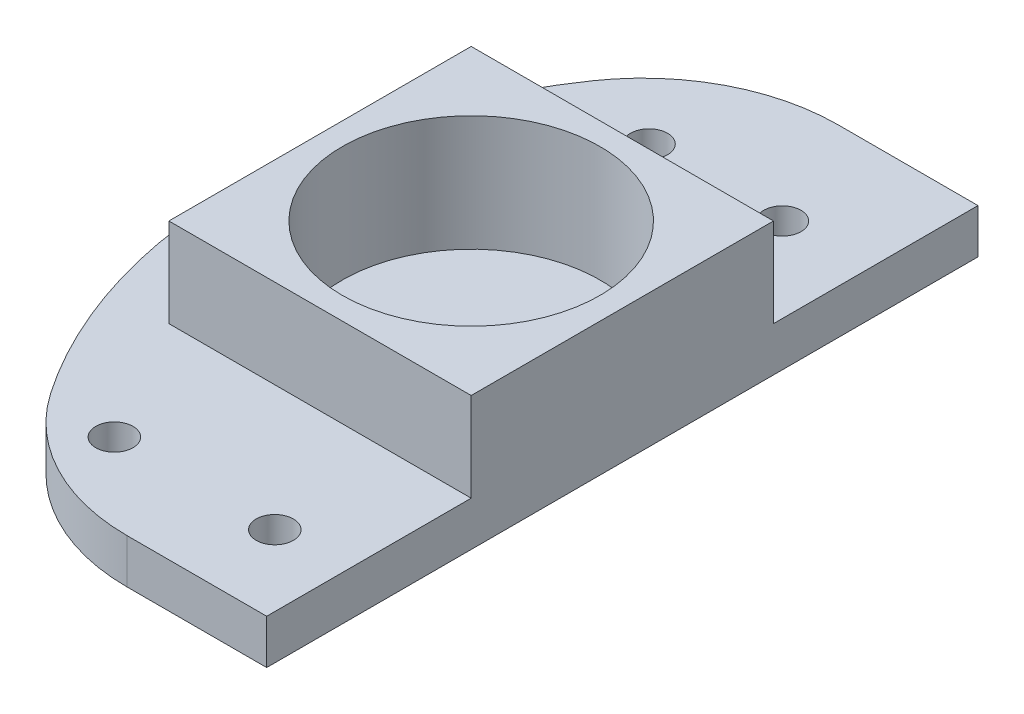
ISO-10303-21;
HEADER;
FILE_DESCRIPTION(('STEP AP214'),'2;1');
FILE_NAME('part.step','',(''),(''),'','','');
FILE_SCHEMA(('AUTOMOTIVE_DESIGN { 1 0 10303 214 1 1 1 1 }'));
ENDSEC;
DATA;
#1=APPLICATION_CONTEXT('core data for automotive mechanical design processes');
#2=APPLICATION_PROTOCOL_DEFINITION('international standard','automotive_design',2000,#1);
#3=PRODUCT_CONTEXT('',#1,'mechanical');
#4=PRODUCT('Part','Part','',(#3));
#5=PRODUCT_RELATED_PRODUCT_CATEGORY('part','',(#4));
#6=PRODUCT_DEFINITION_FORMATION('','',#4);
#7=PRODUCT_DEFINITION_CONTEXT('part definition',#1,'design');
#8=PRODUCT_DEFINITION('design','',#6,#7);
#9=PRODUCT_DEFINITION_SHAPE('','',#8);
#10=(LENGTH_UNIT() NAMED_UNIT(*) SI_UNIT(.MILLI.,.METRE.));
#11=(NAMED_UNIT(*) PLANE_ANGLE_UNIT() SI_UNIT($,.RADIAN.));
#12=(NAMED_UNIT(*) SI_UNIT($,.STERADIAN.) SOLID_ANGLE_UNIT());
#13=UNCERTAINTY_MEASURE_WITH_UNIT(LENGTH_MEASURE(1.E-05),#10,'distance_accuracy_value','');
#14=(GEOMETRIC_REPRESENTATION_CONTEXT(3) GLOBAL_UNCERTAINTY_ASSIGNED_CONTEXT((#13)) GLOBAL_UNIT_ASSIGNED_CONTEXT((#10,
#11,#12)) REPRESENTATION_CONTEXT('',''));
#15=CARTESIAN_POINT('',(0.,0.,0.));
#16=DIRECTION('',(0.,0.,1.));
#17=DIRECTION('',(1.,0.,0.));
#18=AXIS2_PLACEMENT_3D('',#15,#16,#17);
#19=CARTESIAN_POINT('',(0.,6.35,0.));
#20=DIRECTION('',(0.,1.,0.));
#21=DIRECTION('',(0.,0.,1.));
#22=AXIS2_PLACEMENT_3D('',#19,#20,#21);
#23=PLANE('',#22);
#24=CARTESIAN_POINT('',(-9.525,6.35,-34.925));
#25=DIRECTION('',(0.,1.,0.));
#26=DIRECTION('',(0.,0.,1.));
#27=AXIS2_PLACEMENT_3D('',#24,#25,#26);
#28=CIRCLE('',#27,2.65429999999999);
#29=CARTESIAN_POINT('',(-9.525,6.35,-32.2707));
#30=VERTEX_POINT('',#29);
#31=EDGE_CURVE('E366',#30,#30,#28,.T.);
#32=ORIENTED_EDGE('',*,*,#31,.F.);
#33=EDGE_LOOP('',(#32));
#34=FACE_BOUND('',#33,.T.);
#35=CARTESIAN_POINT('',(9.525,6.35,-34.925));
#36=DIRECTION('',(0.,1.,0.));
#37=DIRECTION('',(0.,0.,1.));
#38=AXIS2_PLACEMENT_3D('',#35,#36,#37);
#39=CIRCLE('',#38,2.65429999999999);
#40=CARTESIAN_POINT('',(9.525,6.35,-32.2707));
#41=VERTEX_POINT('',#40);
#42=EDGE_CURVE('E368',#41,#41,#39,.T.);
#43=ORIENTED_EDGE('',*,*,#42,.F.);
#44=EDGE_LOOP('',(#43));
#45=FACE_BOUND('',#44,.T.);
#46=CARTESIAN_POINT('',(11.4568909611128,6.35,39.5116158235074));
#47=DIRECTION('',(0.,1.,0.));
#48=DIRECTION('',(0.,0.,1.));
#49=AXIS2_PLACEMENT_3D('',#46,#47,#48);
#50=CIRCLE('',#49,2.65429999999999);
#51=CARTESIAN_POINT('',(11.4568909611128,6.35,42.1659158235074));
#52=VERTEX_POINT('',#51);
#53=EDGE_CURVE('E376',#52,#52,#50,.T.);
#54=ORIENTED_EDGE('',*,*,#53,.F.);
#55=EDGE_LOOP('',(#54));
#56=FACE_BOUND('',#55,.T.);
#57=CARTESIAN_POINT('',(-11.4568909611128,6.35,39.5116158235074));
#58=DIRECTION('',(0.,1.,0.));
#59=DIRECTION('',(0.,0.,1.));
#60=AXIS2_PLACEMENT_3D('',#57,#58,#59);
#61=CIRCLE('',#60,2.65429999999999);
#62=CARTESIAN_POINT('',(-11.4568909611128,6.35,42.1659158235074));
#63=VERTEX_POINT('',#62);
#64=EDGE_CURVE('E146',#63,#63,#61,.T.);
#65=ORIENTED_EDGE('',*,*,#64,.F.);
#66=EDGE_LOOP('',(#65));
#67=FACE_BOUND('',#66,.T.);
#68=DIRECTION('',(-1.,0.,0.));
#69=VECTOR('',#68,1.);
#70=CARTESIAN_POINT('',(0.,6.35,-50.8));
#71=LINE('',#70,#69);
#72=CARTESIAN_POINT('',(21.59,6.35,-50.8));
#73=VERTEX_POINT('',#72);
#74=CARTESIAN_POINT('',(1.63161633297087,6.35,-50.8));
#75=VERTEX_POINT('',#74);
#76=EDGE_CURVE('E130',#73,#75,#71,.T.);
#77=ORIENTED_EDGE('',*,*,#76,.T.);
#78=CARTESIAN_POINT('',(1.63161633297088,6.35,-22.86));
#79=DIRECTION('',(0.,1.,0.));
#80=DIRECTION('',(0.,0.,1.));
#81=AXIS2_PLACEMENT_3D('',#78,#79,#80);
#82=CIRCLE('',#81,27.94);
#83=CARTESIAN_POINT('',(-21.4015421788103,6.35,-38.6750943396226));
#84=VERTEX_POINT('',#83);
#85=EDGE_CURVE('E197',#75,#84,#82,.T.);
#86=ORIENTED_EDGE('',*,*,#85,.T.);
#87=CARTESIAN_POINT('',(34.925,6.35,0.));
#88=DIRECTION('',(0.,1.,0.));
#89=DIRECTION('',(0.,0.,1.));
#90=AXIS2_PLACEMENT_3D('',#87,#88,#89);
#91=CIRCLE('',#90,68.326);
#92=CARTESIAN_POINT('',(-21.4015421788102,6.35,38.6750943396227));
#93=VERTEX_POINT('',#92);
#94=EDGE_CURVE('E135',#84,#93,#91,.T.);
#95=ORIENTED_EDGE('',*,*,#94,.T.);
#96=CARTESIAN_POINT('',(1.63161633297088,6.35,22.86));
#97=DIRECTION('',(0.,1.,0.));
#98=DIRECTION('',(0.,0.,1.));
#99=AXIS2_PLACEMENT_3D('',#96,#97,#98);
#100=CIRCLE('',#99,27.94);
#101=CARTESIAN_POINT('',(1.63161633297089,6.35,50.8));
#102=VERTEX_POINT('',#101);
#103=EDGE_CURVE('E195',#93,#102,#100,.T.);
#104=ORIENTED_EDGE('',*,*,#103,.T.);
#105=DIRECTION('',(-1.,0.,0.));
#106=VECTOR('',#105,1.);
#107=CARTESIAN_POINT('',(0.,6.35,50.8));
#108=LINE('',#107,#106);
#109=CARTESIAN_POINT('',(21.59,6.35,50.8));
#110=VERTEX_POINT('',#109);
#111=EDGE_CURVE('E144',#110,#102,#108,.T.);
#112=ORIENTED_EDGE('',*,*,#111,.F.);
#113=DIRECTION('',(0.,0.,-1.));
#114=VECTOR('',#113,1.);
#115=CARTESIAN_POINT('',(21.59,6.35,0.));
#116=LINE('',#115,#114);
#117=CARTESIAN_POINT('',(21.59,6.35,21.59));
#118=VERTEX_POINT('',#117);
#119=EDGE_CURVE('E141',#110,#118,#116,.T.);
#120=ORIENTED_EDGE('',*,*,#119,.T.);
#121=DIRECTION('',(1.,0.,0.));
#122=VECTOR('',#121,1.);
#123=CARTESIAN_POINT('',(0.,6.35,21.59));
#124=LINE('',#123,#122);
#125=CARTESIAN_POINT('',(-21.59,6.35,21.59));
#126=VERTEX_POINT('',#125);
#127=EDGE_CURVE('E155',#126,#118,#124,.T.);
#128=ORIENTED_EDGE('',*,*,#127,.F.);
#129=DIRECTION('',(0.,0.,-1.));
#130=VECTOR('',#129,1.);
#131=CARTESIAN_POINT('',(-21.59,6.35,0.));
#132=LINE('',#131,#130);
#133=CARTESIAN_POINT('',(-21.59,6.35,-21.59));
#134=VERTEX_POINT('',#133);
#135=EDGE_CURVE('E158',#126,#134,#132,.T.);
#136=ORIENTED_EDGE('',*,*,#135,.T.);
#137=DIRECTION('',(1.,0.,0.));
#138=VECTOR('',#137,1.);
#139=CARTESIAN_POINT('',(0.,6.35,-21.59));
#140=LINE('',#139,#138);
#141=CARTESIAN_POINT('',(21.59,6.35,-21.59));
#142=VERTEX_POINT('',#141);
#143=EDGE_CURVE('E140',#134,#142,#140,.T.);
#144=ORIENTED_EDGE('',*,*,#143,.T.);
#145=EDGE_CURVE('E117',#142,#73,#116,.T.);
#146=ORIENTED_EDGE('',*,*,#145,.T.);
#147=EDGE_LOOP('',(#77,#86,#95,#104,#112,#120,#128,#136,#144,#146));
#148=FACE_BOUND('',#147,.T.);
#149=ADVANCED_FACE('F37',(#34,#45,#56,#67,#148),#23,.T.);
#150=CARTESIAN_POINT('',(0.,19.05,0.));
#151=DIRECTION('',(0.,1.,0.));
#152=DIRECTION('',(0.,0.,1.));
#153=AXIS2_PLACEMENT_3D('',#150,#151,#152);
#154=PLANE('',#153);
#155=CARTESIAN_POINT('',(0.,19.05,0.));
#156=DIRECTION('',(0.,1.,0.));
#157=DIRECTION('',(0.,0.,1.));
#158=AXIS2_PLACEMENT_3D('',#155,#156,#157);
#159=CIRCLE('',#158,18.415);
#160=CARTESIAN_POINT('',(0.,19.05,18.415));
#161=VERTEX_POINT('',#160);
#162=EDGE_CURVE('E175',#161,#161,#159,.T.);
#163=ORIENTED_EDGE('',*,*,#162,.F.);
#164=EDGE_LOOP('',(#163));
#165=FACE_BOUND('',#164,.T.);
#166=DIRECTION('',(1.,0.,0.));
#167=VECTOR('',#166,1.);
#168=CARTESIAN_POINT('',(0.,19.05,21.59));
#169=LINE('',#168,#167);
#170=CARTESIAN_POINT('',(-21.59,19.05,21.59));
#171=VERTEX_POINT('',#170);
#172=CARTESIAN_POINT('',(21.59,19.05,21.59));
#173=VERTEX_POINT('',#172);
#174=EDGE_CURVE('E165',#171,#173,#169,.T.);
#175=ORIENTED_EDGE('',*,*,#174,.T.);
#176=DIRECTION('',(0.,0.,-1.));
#177=VECTOR('',#176,1.);
#178=CARTESIAN_POINT('',(21.59,19.05,0.));
#179=LINE('',#178,#177);
#180=CARTESIAN_POINT('',(21.59,19.05,-21.59));
#181=VERTEX_POINT('',#180);
#182=EDGE_CURVE('E125',#173,#181,#179,.T.);
#183=ORIENTED_EDGE('',*,*,#182,.T.);
#184=DIRECTION('',(1.,0.,0.));
#185=VECTOR('',#184,1.);
#186=CARTESIAN_POINT('',(0.,19.05,-21.59));
#187=LINE('',#186,#185);
#188=CARTESIAN_POINT('',(-21.59,19.05,-21.59));
#189=VERTEX_POINT('',#188);
#190=EDGE_CURVE('E159',#189,#181,#187,.T.);
#191=ORIENTED_EDGE('',*,*,#190,.F.);
#192=DIRECTION('',(0.,0.,-1.));
#193=VECTOR('',#192,1.);
#194=CARTESIAN_POINT('',(-21.59,19.05,0.));
#195=LINE('',#194,#193);
#196=EDGE_CURVE('E168',#171,#189,#195,.T.);
#197=ORIENTED_EDGE('',*,*,#196,.F.);
#198=EDGE_LOOP('',(#175,#183,#191,#197));
#199=FACE_BOUND('',#198,.T.);
#200=ADVANCED_FACE('F229',(#165,#199),#154,.T.);
#201=CARTESIAN_POINT('',(0.,2.54,0.));
#202=DIRECTION('',(0.,1.,0.));
#203=DIRECTION('',(0.,0.,1.));
#204=AXIS2_PLACEMENT_3D('',#201,#202,#203);
#205=CYLINDRICAL_SURFACE('',#204,18.415);
#206=CARTESIAN_POINT('',(0.,2.54,0.));
#207=DIRECTION('',(0.,1.,0.));
#208=DIRECTION('',(0.,0.,1.));
#209=AXIS2_PLACEMENT_3D('',#206,#207,#208);
#210=CIRCLE('',#209,18.415);
#211=CARTESIAN_POINT('',(0.,2.54,18.415));
#212=VERTEX_POINT('',#211);
#213=EDGE_CURVE('E182',#212,#212,#210,.T.);
#214=ORIENTED_EDGE('',*,*,#213,.F.);
#215=EDGE_LOOP('',(#214));
#216=FACE_BOUND('',#215,.T.);
#217=ORIENTED_EDGE('',*,*,#162,.T.);
#218=EDGE_LOOP('',(#217));
#219=FACE_BOUND('',#218,.T.);
#220=ADVANCED_FACE('F231',(#216,#219),#205,.F.);
#221=CARTESIAN_POINT('',(0.,2.54,0.));
#222=DIRECTION('',(0.,1.,0.));
#223=DIRECTION('',(0.,0.,1.));
#224=AXIS2_PLACEMENT_3D('',#221,#222,#223);
#225=PLANE('',#224);
#226=ORIENTED_EDGE('',*,*,#213,.T.);
#227=EDGE_LOOP('',(#226));
#228=FACE_BOUND('',#227,.T.);
#229=ADVANCED_FACE('F238',(#228),#225,.T.);
#230=CARTESIAN_POINT('',(21.59,6.35,0.));
#231=DIRECTION('',(1.,0.,0.));
#232=DIRECTION('',(0.,0.,-1.));
#233=AXIS2_PLACEMENT_3D('',#230,#231,#232);
#234=PLANE('',#233);
#235=ORIENTED_EDGE('',*,*,#182,.F.);
#236=DIRECTION('',(0.,1.,0.));
#237=VECTOR('',#236,1.);
#238=CARTESIAN_POINT('',(21.59,6.35,21.59));
#239=LINE('',#238,#237);
#240=EDGE_CURVE('E162',#118,#173,#239,.T.);
#241=ORIENTED_EDGE('',*,*,#240,.F.);
#242=ORIENTED_EDGE('',*,*,#119,.F.);
#243=DIRECTION('',(0.,1.,0.));
#244=VECTOR('',#243,1.);
#245=CARTESIAN_POINT('',(21.59,-6.35,50.8));
#246=LINE('',#245,#244);
#247=CARTESIAN_POINT('',(21.59,0.,50.8));
#248=VERTEX_POINT('',#247);
#249=EDGE_CURVE('E126',#248,#110,#246,.T.);
#250=ORIENTED_EDGE('',*,*,#249,.F.);
#251=DIRECTION('',(0.,0.,-1.));
#252=VECTOR('',#251,1.);
#253=CARTESIAN_POINT('',(21.59,0.,0.));
#254=LINE('',#253,#252);
#255=CARTESIAN_POINT('',(21.59,0.,-50.8));
#256=VERTEX_POINT('',#255);
#257=EDGE_CURVE('E121',#248,#256,#254,.T.);
#258=ORIENTED_EDGE('',*,*,#257,.T.);
#259=DIRECTION('',(0.,1.,0.));
#260=VECTOR('',#259,1.);
#261=CARTESIAN_POINT('',(21.59,-6.35,-50.8));
#262=LINE('',#261,#260);
#263=EDGE_CURVE('E113',#256,#73,#262,.T.);
#264=ORIENTED_EDGE('',*,*,#263,.T.);
#265=ORIENTED_EDGE('',*,*,#145,.F.);
#266=DIRECTION('',(0.,1.,0.));
#267=VECTOR('',#266,1.);
#268=CARTESIAN_POINT('',(21.59,6.35,-21.59));
#269=LINE('',#268,#267);
#270=EDGE_CURVE('E173',#142,#181,#269,.T.);
#271=ORIENTED_EDGE('',*,*,#270,.T.);
#272=EDGE_LOOP('',(#235,#241,#242,#250,#258,#264,#265,#271));
#273=FACE_BOUND('',#272,.T.);
#274=ADVANCED_FACE('F115',(#273),#234,.T.);
#275=CARTESIAN_POINT('',(0.,6.35,-21.59));
#276=DIRECTION('',(0.,0.,1.));
#277=DIRECTION('',(1.,0.,0.));
#278=AXIS2_PLACEMENT_3D('',#275,#276,#277);
#279=PLANE('',#278);
#280=ORIENTED_EDGE('',*,*,#190,.T.);
#281=ORIENTED_EDGE('',*,*,#270,.F.);
#282=ORIENTED_EDGE('',*,*,#143,.F.);
#283=DIRECTION('',(0.,1.,0.));
#284=VECTOR('',#283,1.);
#285=CARTESIAN_POINT('',(-21.59,6.35,-21.59));
#286=LINE('',#285,#284);
#287=EDGE_CURVE('E176',#134,#189,#286,.T.);
#288=ORIENTED_EDGE('',*,*,#287,.T.);
#289=EDGE_LOOP('',(#280,#281,#282,#288));
#290=FACE_BOUND('',#289,.T.);
#291=ADVANCED_FACE('F227',(#290),#279,.F.);
#292=CARTESIAN_POINT('',(-21.59,6.35,0.));
#293=DIRECTION('',(1.,0.,0.));
#294=DIRECTION('',(0.,0.,-1.));
#295=AXIS2_PLACEMENT_3D('',#292,#293,#294);
#296=PLANE('',#295);
#297=ORIENTED_EDGE('',*,*,#196,.T.);
#298=ORIENTED_EDGE('',*,*,#287,.F.);
#299=ORIENTED_EDGE('',*,*,#135,.F.);
#300=DIRECTION('',(0.,1.,0.));
#301=VECTOR('',#300,1.);
#302=CARTESIAN_POINT('',(-21.59,6.35,21.59));
#303=LINE('',#302,#301);
#304=EDGE_CURVE('E178',#126,#171,#303,.T.);
#305=ORIENTED_EDGE('',*,*,#304,.T.);
#306=EDGE_LOOP('',(#297,#298,#299,#305));
#307=FACE_BOUND('',#306,.T.);
#308=ADVANCED_FACE('F224',(#307),#296,.F.);
#309=CARTESIAN_POINT('',(0.,6.35,21.59));
#310=DIRECTION('',(0.,0.,1.));
#311=DIRECTION('',(1.,0.,0.));
#312=AXIS2_PLACEMENT_3D('',#309,#310,#311);
#313=PLANE('',#312);
#314=ORIENTED_EDGE('',*,*,#174,.F.);
#315=ORIENTED_EDGE('',*,*,#304,.F.);
#316=ORIENTED_EDGE('',*,*,#127,.T.);
#317=ORIENTED_EDGE('',*,*,#240,.T.);
#318=EDGE_LOOP('',(#314,#315,#316,#317));
#319=FACE_BOUND('',#318,.T.);
#320=ADVANCED_FACE('F221',(#319),#313,.T.);
#321=CARTESIAN_POINT('',(0.,-6.35,-50.8));
#322=DIRECTION('',(0.,0.,-1.));
#323=DIRECTION('',(-1.,0.,0.));
#324=AXIS2_PLACEMENT_3D('',#321,#322,#323);
#325=PLANE('',#324);
#326=DIRECTION('',(-1.,0.,0.));
#327=VECTOR('',#326,1.);
#328=CARTESIAN_POINT('',(0.,0.,-50.8));
#329=LINE('',#328,#327);
#330=CARTESIAN_POINT('',(1.63161633297087,0.,-50.8));
#331=VERTEX_POINT('',#330);
#332=EDGE_CURVE('E191',#256,#331,#329,.T.);
#333=ORIENTED_EDGE('',*,*,#332,.T.);
#334=DIRECTION('',(0.,1.,0.));
#335=VECTOR('',#334,1.);
#336=CARTESIAN_POINT('',(1.63161633297087,-6.35,-50.8));
#337=LINE('',#336,#335);
#338=EDGE_CURVE('E133',#331,#75,#337,.T.);
#339=ORIENTED_EDGE('',*,*,#338,.T.);
#340=ORIENTED_EDGE('',*,*,#76,.F.);
#341=ORIENTED_EDGE('',*,*,#263,.F.);
#342=EDGE_LOOP('',(#333,#339,#340,#341));
#343=FACE_BOUND('',#342,.T.);
#344=ADVANCED_FACE('F131',(#343),#325,.T.);
#345=CARTESIAN_POINT('',(34.925,-6.35,0.));
#346=DIRECTION('',(0.,1.,0.));
#347=DIRECTION('',(0.,0.,1.));
#348=AXIS2_PLACEMENT_3D('',#345,#346,#347);
#349=CYLINDRICAL_SURFACE('',#348,68.326);
#350=ORIENTED_EDGE('',*,*,#94,.F.);
#351=DIRECTION('',(0.,1.,0.));
#352=VECTOR('',#351,1.);
#353=CARTESIAN_POINT('',(-21.4015421788103,-6.35,-38.6750943396226));
#354=LINE('',#353,#352);
#355=CARTESIAN_POINT('',(-21.4015421788103,0.,-38.6750943396226));
#356=VERTEX_POINT('',#355);
#357=EDGE_CURVE('E202',#84,#356,#354,.F.);
#358=ORIENTED_EDGE('',*,*,#357,.T.);
#359=CARTESIAN_POINT('',(34.925,0.,0.));
#360=DIRECTION('',(0.,1.,0.));
#361=DIRECTION('',(0.,0.,1.));
#362=AXIS2_PLACEMENT_3D('',#359,#360,#361);
#363=CIRCLE('',#362,68.326);
#364=CARTESIAN_POINT('',(-21.4015421788102,0.,38.6750943396227));
#365=VERTEX_POINT('',#364);
#366=EDGE_CURVE('E189',#356,#365,#363,.T.);
#367=ORIENTED_EDGE('',*,*,#366,.T.);
#368=DIRECTION('',(0.,1.,0.));
#369=VECTOR('',#368,1.);
#370=CARTESIAN_POINT('',(-21.4015421788103,-6.35,38.6750943396227));
#371=LINE('',#370,#369);
#372=EDGE_CURVE('E199',#365,#93,#371,.T.);
#373=ORIENTED_EDGE('',*,*,#372,.T.);
#374=EDGE_LOOP('',(#350,#358,#367,#373));
#375=FACE_BOUND('',#374,.T.);
#376=ADVANCED_FACE('F211',(#375),#349,.T.);
#377=CARTESIAN_POINT('',(0.,-6.35,50.8));
#378=DIRECTION('',(0.,0.,-1.));
#379=DIRECTION('',(-1.,0.,0.));
#380=AXIS2_PLACEMENT_3D('',#377,#378,#379);
#381=PLANE('',#380);
#382=ORIENTED_EDGE('',*,*,#111,.T.);
#383=DIRECTION('',(0.,-1.,0.));
#384=VECTOR('',#383,1.);
#385=CARTESIAN_POINT('',(1.63161633297089,0.,50.8));
#386=LINE('',#385,#384);
#387=CARTESIAN_POINT('',(1.63161633297089,0.,50.8));
#388=VERTEX_POINT('',#387);
#389=EDGE_CURVE('E11',#102,#388,#386,.T.);
#390=ORIENTED_EDGE('',*,*,#389,.T.);
#391=DIRECTION('',(-1.,0.,0.));
#392=VECTOR('',#391,1.);
#393=CARTESIAN_POINT('',(0.,0.,50.8));
#394=LINE('',#393,#392);
#395=EDGE_CURVE('E185',#248,#388,#394,.T.);
#396=ORIENTED_EDGE('',*,*,#395,.F.);
#397=ORIENTED_EDGE('',*,*,#249,.T.);
#398=EDGE_LOOP('',(#382,#390,#396,#397));
#399=FACE_BOUND('',#398,.T.);
#400=ADVANCED_FACE('F215',(#399),#381,.F.);
#401=CARTESIAN_POINT('',(0.,0.,0.));
#402=DIRECTION('',(0.,1.,0.));
#403=DIRECTION('',(0.,0.,1.));
#404=AXIS2_PLACEMENT_3D('',#401,#402,#403);
#405=PLANE('',#404);
#406=CARTESIAN_POINT('',(-9.525,0.,-34.925));
#407=DIRECTION('',(0.,1.,0.));
#408=DIRECTION('',(0.,0.,1.));
#409=AXIS2_PLACEMENT_3D('',#406,#407,#408);
#410=CIRCLE('',#409,2.65429999999999);
#411=CARTESIAN_POINT('',(-9.525,0.,-32.2707));
#412=VERTEX_POINT('',#411);
#413=EDGE_CURVE('E363',#412,#412,#410,.T.);
#414=ORIENTED_EDGE('',*,*,#413,.T.);
#415=EDGE_LOOP('',(#414));
#416=FACE_BOUND('',#415,.T.);
#417=CARTESIAN_POINT('',(9.525,0.,-34.925));
#418=DIRECTION('',(0.,1.,0.));
#419=DIRECTION('',(0.,0.,1.));
#420=AXIS2_PLACEMENT_3D('',#417,#418,#419);
#421=CIRCLE('',#420,2.65429999999999);
#422=CARTESIAN_POINT('',(9.525,0.,-32.2707));
#423=VERTEX_POINT('',#422);
#424=EDGE_CURVE('E373',#423,#423,#421,.T.);
#425=ORIENTED_EDGE('',*,*,#424,.T.);
#426=EDGE_LOOP('',(#425));
#427=FACE_BOUND('',#426,.T.);
#428=CARTESIAN_POINT('',(11.4568909611128,0.,39.5116158235074));
#429=DIRECTION('',(0.,1.,0.));
#430=DIRECTION('',(0.,0.,1.));
#431=AXIS2_PLACEMENT_3D('',#428,#429,#430);
#432=CIRCLE('',#431,2.65429999999999);
#433=CARTESIAN_POINT('',(11.4568909611128,0.,42.1659158235074));
#434=VERTEX_POINT('',#433);
#435=EDGE_CURVE('E379',#434,#434,#432,.T.);
#436=ORIENTED_EDGE('',*,*,#435,.T.);
#437=EDGE_LOOP('',(#436));
#438=FACE_BOUND('',#437,.T.);
#439=CARTESIAN_POINT('',(-11.4568909611128,0.,39.5116158235074));
#440=DIRECTION('',(0.,1.,0.));
#441=DIRECTION('',(0.,0.,1.));
#442=AXIS2_PLACEMENT_3D('',#439,#440,#441);
#443=CIRCLE('',#442,2.65429999999999);
#444=CARTESIAN_POINT('',(-11.4568909611128,0.,42.1659158235074));
#445=VERTEX_POINT('',#444);
#446=EDGE_CURVE('E142',#445,#445,#443,.T.);
#447=ORIENTED_EDGE('',*,*,#446,.T.);
#448=EDGE_LOOP('',(#447));
#449=FACE_BOUND('',#448,.T.);
#450=ORIENTED_EDGE('',*,*,#366,.F.);
#451=CARTESIAN_POINT('',(1.63161633297088,0.,-22.86));
#452=DIRECTION('',(0.,1.,0.));
#453=DIRECTION('',(0.,0.,1.));
#454=AXIS2_PLACEMENT_3D('',#451,#452,#453);
#455=CIRCLE('',#454,27.94);
#456=EDGE_CURVE('E45',#356,#331,#455,.F.);
#457=ORIENTED_EDGE('',*,*,#456,.T.);
#458=ORIENTED_EDGE('',*,*,#332,.F.);
#459=ORIENTED_EDGE('',*,*,#257,.F.);
#460=ORIENTED_EDGE('',*,*,#395,.T.);
#461=CARTESIAN_POINT('',(1.63161633297088,0.,22.86));
#462=DIRECTION('',(0.,1.,0.));
#463=DIRECTION('',(0.,0.,1.));
#464=AXIS2_PLACEMENT_3D('',#461,#462,#463);
#465=CIRCLE('',#464,27.94);
#466=EDGE_CURVE('E57',#388,#365,#465,.F.);
#467=ORIENTED_EDGE('',*,*,#466,.T.);
#468=EDGE_LOOP('',(#450,#457,#458,#459,#460,#467));
#469=FACE_BOUND('',#468,.T.);
#470=ADVANCED_FACE('F205',(#416,#427,#438,#449,#469),#405,.F.);
#471=CARTESIAN_POINT('',(1.63161633297088,-6.35,-22.86));
#472=DIRECTION('',(0.,1.,0.));
#473=DIRECTION('',(0.,0.,1.));
#474=AXIS2_PLACEMENT_3D('',#471,#472,#473);
#475=CYLINDRICAL_SURFACE('',#474,27.94);
#476=ORIENTED_EDGE('',*,*,#456,.F.);
#477=ORIENTED_EDGE('',*,*,#357,.F.);
#478=ORIENTED_EDGE('',*,*,#85,.F.);
#479=ORIENTED_EDGE('',*,*,#338,.F.);
#480=EDGE_LOOP('',(#476,#477,#478,#479));
#481=FACE_BOUND('',#480,.T.);
#482=ADVANCED_FACE('F208',(#481),#475,.T.);
#483=CARTESIAN_POINT('',(1.63161633297088,-6.35,22.86));
#484=DIRECTION('',(0.,1.,0.));
#485=DIRECTION('',(0.,0.,1.));
#486=AXIS2_PLACEMENT_3D('',#483,#484,#485);
#487=CYLINDRICAL_SURFACE('',#486,27.94);
#488=ORIENTED_EDGE('',*,*,#466,.F.);
#489=ORIENTED_EDGE('',*,*,#389,.F.);
#490=ORIENTED_EDGE('',*,*,#103,.F.);
#491=ORIENTED_EDGE('',*,*,#372,.F.);
#492=EDGE_LOOP('',(#488,#489,#490,#491));
#493=FACE_BOUND('',#492,.T.);
#494=ADVANCED_FACE('F39',(#493),#487,.T.);
#495=CARTESIAN_POINT('',(-11.4568909611128,6.35,39.5116158235074));
#496=DIRECTION('',(0.,1.,0.));
#497=DIRECTION('',(0.,0.,1.));
#498=AXIS2_PLACEMENT_3D('',#495,#496,#497);
#499=CYLINDRICAL_SURFACE('',#498,2.65429999999999);
#500=ORIENTED_EDGE('',*,*,#446,.F.);
#501=EDGE_LOOP('',(#500));
#502=FACE_BOUND('',#501,.T.);
#503=ORIENTED_EDGE('',*,*,#64,.T.);
#504=EDGE_LOOP('',(#503));
#505=FACE_BOUND('',#504,.T.);
#506=ADVANCED_FACE('F252',(#502,#505),#499,.F.);
#507=CARTESIAN_POINT('',(11.4568909611128,6.35,39.5116158235074));
#508=DIRECTION('',(0.,1.,0.));
#509=DIRECTION('',(0.,0.,1.));
#510=AXIS2_PLACEMENT_3D('',#507,#508,#509);
#511=CYLINDRICAL_SURFACE('',#510,2.65429999999999);
#512=ORIENTED_EDGE('',*,*,#435,.F.);
#513=EDGE_LOOP('',(#512));
#514=FACE_BOUND('',#513,.T.);
#515=ORIENTED_EDGE('',*,*,#53,.T.);
#516=EDGE_LOOP('',(#515));
#517=FACE_BOUND('',#516,.T.);
#518=ADVANCED_FACE('F256',(#514,#517),#511,.F.);
#519=CARTESIAN_POINT('',(9.525,6.35,-34.925));
#520=DIRECTION('',(0.,1.,0.));
#521=DIRECTION('',(0.,0.,1.));
#522=AXIS2_PLACEMENT_3D('',#519,#520,#521);
#523=CYLINDRICAL_SURFACE('',#522,2.65429999999999);
#524=ORIENTED_EDGE('',*,*,#424,.F.);
#525=EDGE_LOOP('',(#524));
#526=FACE_BOUND('',#525,.T.);
#527=ORIENTED_EDGE('',*,*,#42,.T.);
#528=EDGE_LOOP('',(#527));
#529=FACE_BOUND('',#528,.T.);
#530=ADVANCED_FACE('F262',(#526,#529),#523,.F.);
#531=CARTESIAN_POINT('',(-9.525,6.35,-34.925));
#532=DIRECTION('',(0.,1.,0.));
#533=DIRECTION('',(0.,0.,1.));
#534=AXIS2_PLACEMENT_3D('',#531,#532,#533);
#535=CYLINDRICAL_SURFACE('',#534,2.65429999999999);
#536=ORIENTED_EDGE('',*,*,#413,.F.);
#537=EDGE_LOOP('',(#536));
#538=FACE_BOUND('',#537,.T.);
#539=ORIENTED_EDGE('',*,*,#31,.T.);
#540=EDGE_LOOP('',(#539));
#541=FACE_BOUND('',#540,.T.);
#542=ADVANCED_FACE('F347',(#538,#541),#535,.F.);
#543=CLOSED_SHELL('',(#149,#200,#220,#229,#274,#291,#308,#320,#344,#376,#400,#470,#482,#494,
#506,#518,#530,#542));
#544=MANIFOLD_SOLID_BREP('B2',#543);
#545=ADVANCED_BREP_SHAPE_REPRESENTATION('',(#18,#544),#14);
#546=SHAPE_DEFINITION_REPRESENTATION(#9,#545);
ENDSEC;
END-ISO-10303-21;
